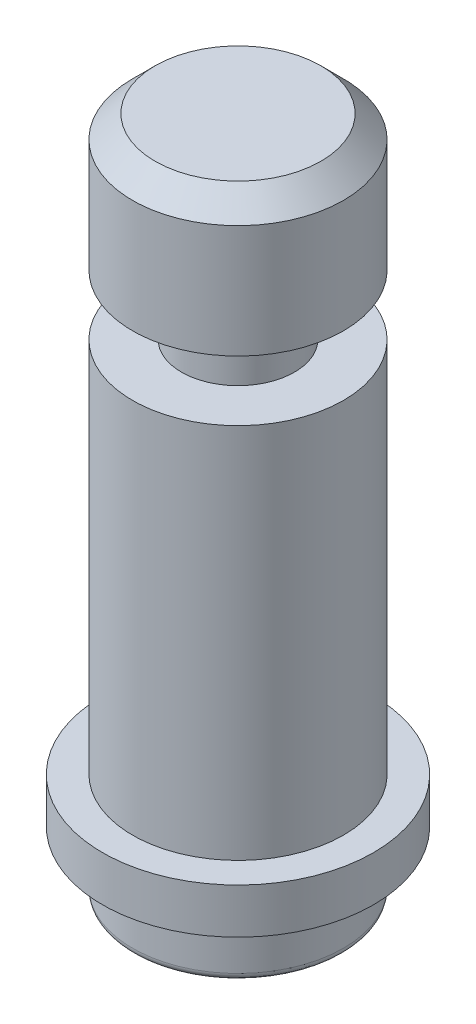
ISO-10303-21;
HEADER;
FILE_DESCRIPTION(('STEP AP214'),'2;1');
FILE_NAME('part.step','',(''),(''),'','','');
FILE_SCHEMA(('AUTOMOTIVE_DESIGN { 1 0 10303 214 1 1 1 1 }'));
ENDSEC;
DATA;
#1=APPLICATION_CONTEXT('core data for automotive mechanical design processes');
#2=APPLICATION_PROTOCOL_DEFINITION('international standard','automotive_design',2000,#1);
#3=PRODUCT_CONTEXT('',#1,'mechanical');
#4=PRODUCT('Part','Part','',(#3));
#5=PRODUCT_RELATED_PRODUCT_CATEGORY('part','',(#4));
#6=PRODUCT_DEFINITION_FORMATION('','',#4);
#7=PRODUCT_DEFINITION_CONTEXT('part definition',#1,'design');
#8=PRODUCT_DEFINITION('design','',#6,#7);
#9=PRODUCT_DEFINITION_SHAPE('','',#8);
#10=(LENGTH_UNIT() NAMED_UNIT(*) SI_UNIT(.MILLI.,.METRE.));
#11=(NAMED_UNIT(*) PLANE_ANGLE_UNIT() SI_UNIT($,.RADIAN.));
#12=(NAMED_UNIT(*) SI_UNIT($,.STERADIAN.) SOLID_ANGLE_UNIT());
#13=UNCERTAINTY_MEASURE_WITH_UNIT(LENGTH_MEASURE(1.E-05),#10,'distance_accuracy_value','');
#14=(GEOMETRIC_REPRESENTATION_CONTEXT(3) GLOBAL_UNCERTAINTY_ASSIGNED_CONTEXT((#13)) GLOBAL_UNIT_ASSIGNED_CONTEXT((#10,
#11,#12)) REPRESENTATION_CONTEXT('',''));
#15=CARTESIAN_POINT('',(0.,0.,0.));
#16=DIRECTION('',(0.,0.,1.));
#17=DIRECTION('',(1.,0.,0.));
#18=AXIS2_PLACEMENT_3D('',#15,#16,#17);
#19=CARTESIAN_POINT('',(0.,-22.5,0.));
#20=DIRECTION('',(0.,1.,0.));
#21=DIRECTION('',(-1.,0.,0.));
#22=AXIS2_PLACEMENT_3D('',#19,#20,#21);
#23=PLANE('',#22);
#24=CARTESIAN_POINT('',(0.,-22.5,0.));
#25=DIRECTION('',(0.,1.,0.));
#26=DIRECTION('',(-1.,0.,0.));
#27=AXIS2_PLACEMENT_3D('',#24,#25,#26);
#28=CIRCLE('',#27,6.50000000000001);
#29=CARTESIAN_POINT('',(-6.50000000000001,-22.5,0.));
#30=VERTEX_POINT('',#29);
#31=EDGE_CURVE('E10',#30,#30,#28,.F.);
#32=ORIENTED_EDGE('',*,*,#31,.T.);
#33=EDGE_LOOP('',(#32));
#34=FACE_BOUND('',#33,.T.);
#35=ADVANCED_FACE('F31',(#34),#23,.F.);
#36=CARTESIAN_POINT('',(0.,22.5,0.));
#37=DIRECTION('',(0.,1.,0.));
#38=DIRECTION('',(-1.,0.,0.));
#39=AXIS2_PLACEMENT_3D('',#36,#37,#38);
#40=CYLINDRICAL_SURFACE('',#39,7.00000000000001);
#41=CARTESIAN_POINT('',(0.,-22.,0.));
#42=DIRECTION('',(0.,1.,0.));
#43=DIRECTION('',(-1.,0.,0.));
#44=AXIS2_PLACEMENT_3D('',#41,#42,#43);
#45=CIRCLE('',#44,7.00000000000001);
#46=CARTESIAN_POINT('',(-7.00000000000001,-22.,0.));
#47=VERTEX_POINT('',#46);
#48=EDGE_CURVE('E38',#47,#47,#45,.T.);
#49=ORIENTED_EDGE('',*,*,#48,.T.);
#50=EDGE_LOOP('',(#49));
#51=FACE_BOUND('',#50,.T.);
#52=CARTESIAN_POINT('',(0.,-18.5,0.));
#53=DIRECTION('',(0.,1.,0.));
#54=DIRECTION('',(-1.,0.,0.));
#55=AXIS2_PLACEMENT_3D('',#52,#53,#54);
#56=CIRCLE('',#55,7.00000000000001);
#57=CARTESIAN_POINT('',(-7.00000000000001,-18.5,0.));
#58=VERTEX_POINT('',#57);
#59=EDGE_CURVE('E51',#58,#58,#56,.T.);
#60=ORIENTED_EDGE('',*,*,#59,.F.);
#61=EDGE_LOOP('',(#60));
#62=FACE_BOUND('',#61,.T.);
#63=ADVANCED_FACE('F117',(#51,#62),#40,.T.);
#64=CARTESIAN_POINT('',(7.00000000000001,-18.5,0.));
#65=DIRECTION('',(0.,1.,0.));
#66=DIRECTION('',(-1.,0.,0.));
#67=AXIS2_PLACEMENT_3D('',#64,#65,#66);
#68=PLANE('',#67);
#69=CARTESIAN_POINT('',(0.,-18.5,0.));
#70=DIRECTION('',(0.,1.,0.));
#71=DIRECTION('',(-1.,0.,0.));
#72=AXIS2_PLACEMENT_3D('',#69,#70,#71);
#73=CIRCLE('',#72,9.00000000000001);
#74=CARTESIAN_POINT('',(-9.00000000000001,-18.5,0.));
#75=VERTEX_POINT('',#74);
#76=EDGE_CURVE('E54',#75,#75,#73,.T.);
#77=ORIENTED_EDGE('',*,*,#76,.F.);
#78=EDGE_LOOP('',(#77));
#79=FACE_BOUND('',#78,.T.);
#80=ORIENTED_EDGE('',*,*,#59,.T.);
#81=EDGE_LOOP('',(#80));
#82=FACE_BOUND('',#81,.T.);
#83=ADVANCED_FACE('F111',(#79,#82),#68,.F.);
#84=CARTESIAN_POINT('',(0.,22.5,0.));
#85=DIRECTION('',(0.,1.,0.));
#86=DIRECTION('',(-1.,0.,0.));
#87=AXIS2_PLACEMENT_3D('',#84,#85,#86);
#88=CYLINDRICAL_SURFACE('',#87,9.00000000000001);
#89=CARTESIAN_POINT('',(0.,-15.5,0.));
#90=DIRECTION('',(0.,1.,0.));
#91=DIRECTION('',(-1.,0.,0.));
#92=AXIS2_PLACEMENT_3D('',#89,#90,#91);
#93=CIRCLE('',#92,9.00000000000001);
#94=CARTESIAN_POINT('',(-9.00000000000001,-15.5,0.));
#95=VERTEX_POINT('',#94);
#96=EDGE_CURVE('E57',#95,#95,#93,.T.);
#97=ORIENTED_EDGE('',*,*,#96,.F.);
#98=EDGE_LOOP('',(#97));
#99=FACE_BOUND('',#98,.T.);
#100=ORIENTED_EDGE('',*,*,#76,.T.);
#101=EDGE_LOOP('',(#100));
#102=FACE_BOUND('',#101,.T.);
#103=ADVANCED_FACE('F105',(#99,#102),#88,.T.);
#104=CARTESIAN_POINT('',(9.00000000000001,-15.5,0.));
#105=DIRECTION('',(0.,-1.,0.));
#106=DIRECTION('',(1.,0.,0.));
#107=AXIS2_PLACEMENT_3D('',#104,#105,#106);
#108=PLANE('',#107);
#109=CARTESIAN_POINT('',(0.,-15.5,0.));
#110=DIRECTION('',(0.,1.,0.));
#111=DIRECTION('',(-1.,0.,0.));
#112=AXIS2_PLACEMENT_3D('',#109,#110,#111);
#113=CIRCLE('',#112,7.00000000000001);
#114=CARTESIAN_POINT('',(-7.00000000000001,-15.5,0.));
#115=VERTEX_POINT('',#114);
#116=EDGE_CURVE('E60',#115,#115,#113,.T.);
#117=ORIENTED_EDGE('',*,*,#116,.F.);
#118=EDGE_LOOP('',(#117));
#119=FACE_BOUND('',#118,.T.);
#120=ORIENTED_EDGE('',*,*,#96,.T.);
#121=EDGE_LOOP('',(#120));
#122=FACE_BOUND('',#121,.T.);
#123=ADVANCED_FACE('F99',(#119,#122),#108,.F.);
#124=CARTESIAN_POINT('',(0.,22.5,0.));
#125=DIRECTION('',(0.,1.,0.));
#126=DIRECTION('',(-1.,0.,0.));
#127=AXIS2_PLACEMENT_3D('',#124,#125,#126);
#128=CYLINDRICAL_SURFACE('',#127,7.00000000000001);
#129=CARTESIAN_POINT('',(0.,9.5,0.));
#130=DIRECTION('',(0.,1.,0.));
#131=DIRECTION('',(-1.,0.,0.));
#132=AXIS2_PLACEMENT_3D('',#129,#130,#131);
#133=CIRCLE('',#132,7.00000000000002);
#134=CARTESIAN_POINT('',(-7.00000000000002,9.49999999999999,0.));
#135=VERTEX_POINT('',#134);
#136=EDGE_CURVE('E63',#135,#135,#133,.T.);
#137=ORIENTED_EDGE('',*,*,#136,.F.);
#138=EDGE_LOOP('',(#137));
#139=FACE_BOUND('',#138,.T.);
#140=ORIENTED_EDGE('',*,*,#116,.T.);
#141=EDGE_LOOP('',(#140));
#142=FACE_BOUND('',#141,.T.);
#143=ADVANCED_FACE('F93',(#139,#142),#128,.T.);
#144=CARTESIAN_POINT('',(7.00000000000001,9.5,0.));
#145=DIRECTION('',(0.,-1.,0.));
#146=DIRECTION('',(1.,0.,0.));
#147=AXIS2_PLACEMENT_3D('',#144,#145,#146);
#148=PLANE('',#147);
#149=CARTESIAN_POINT('',(0.,9.5,0.));
#150=DIRECTION('',(0.,1.,0.));
#151=DIRECTION('',(-1.,0.,0.));
#152=AXIS2_PLACEMENT_3D('',#149,#150,#151);
#153=CIRCLE('',#152,3.75000000000001);
#154=CARTESIAN_POINT('',(-3.75000000000002,9.5,0.));
#155=VERTEX_POINT('',#154);
#156=EDGE_CURVE('E66',#155,#155,#153,.T.);
#157=ORIENTED_EDGE('',*,*,#156,.F.);
#158=EDGE_LOOP('',(#157));
#159=FACE_BOUND('',#158,.T.);
#160=ORIENTED_EDGE('',*,*,#136,.T.);
#161=EDGE_LOOP('',(#160));
#162=FACE_BOUND('',#161,.T.);
#163=ADVANCED_FACE('F87',(#159,#162),#148,.F.);
#164=CARTESIAN_POINT('',(0.,22.5,0.));
#165=DIRECTION('',(0.,1.,0.));
#166=DIRECTION('',(-1.,0.,0.));
#167=AXIS2_PLACEMENT_3D('',#164,#165,#166);
#168=CYLINDRICAL_SURFACE('',#167,3.75000000000001);
#169=CARTESIAN_POINT('',(0.,13.5,0.));
#170=DIRECTION('',(0.,1.,0.));
#171=DIRECTION('',(-1.,0.,0.));
#172=AXIS2_PLACEMENT_3D('',#169,#170,#171);
#173=CIRCLE('',#172,3.75000000000001);
#174=CARTESIAN_POINT('',(-3.75000000000002,13.5,0.));
#175=VERTEX_POINT('',#174);
#176=EDGE_CURVE('E69',#175,#175,#173,.T.);
#177=ORIENTED_EDGE('',*,*,#176,.F.);
#178=EDGE_LOOP('',(#177));
#179=FACE_BOUND('',#178,.T.);
#180=ORIENTED_EDGE('',*,*,#156,.T.);
#181=EDGE_LOOP('',(#180));
#182=FACE_BOUND('',#181,.T.);
#183=ADVANCED_FACE('F81',(#179,#182),#168,.T.);
#184=CARTESIAN_POINT('',(3.75,13.5,0.));
#185=DIRECTION('',(0.,1.,0.));
#186=DIRECTION('',(-1.,0.,0.));
#187=AXIS2_PLACEMENT_3D('',#184,#185,#186);
#188=PLANE('',#187);
#189=CARTESIAN_POINT('',(0.,13.5,0.));
#190=DIRECTION('',(0.,1.,0.));
#191=DIRECTION('',(-1.,0.,0.));
#192=AXIS2_PLACEMENT_3D('',#189,#190,#191);
#193=CIRCLE('',#192,7.00000000000002);
#194=CARTESIAN_POINT('',(-7.00000000000003,13.5,0.));
#195=VERTEX_POINT('',#194);
#196=EDGE_CURVE('E72',#195,#195,#193,.T.);
#197=ORIENTED_EDGE('',*,*,#196,.F.);
#198=EDGE_LOOP('',(#197));
#199=FACE_BOUND('',#198,.T.);
#200=ORIENTED_EDGE('',*,*,#176,.T.);
#201=EDGE_LOOP('',(#200));
#202=FACE_BOUND('',#201,.T.);
#203=ADVANCED_FACE('F78',(#199,#202),#188,.F.);
#204=CARTESIAN_POINT('',(0.,22.5,0.));
#205=DIRECTION('',(0.,1.,0.));
#206=DIRECTION('',(-1.,0.,0.));
#207=AXIS2_PLACEMENT_3D('',#204,#205,#206);
#208=CYLINDRICAL_SURFACE('',#207,7.00000000000002);
#209=CARTESIAN_POINT('',(0.,21.,0.));
#210=DIRECTION('',(0.,-1.,0.));
#211=DIRECTION('',(1.,0.,0.));
#212=AXIS2_PLACEMENT_3D('',#209,#210,#211);
#213=CIRCLE('',#212,7.00000000000002);
#214=CARTESIAN_POINT('',(7.00000000000001,21.,0.));
#215=VERTEX_POINT('',#214);
#216=EDGE_CURVE('E42',#215,#215,#213,.T.);
#217=ORIENTED_EDGE('',*,*,#216,.T.);
#218=EDGE_LOOP('',(#217));
#219=FACE_BOUND('',#218,.T.);
#220=ORIENTED_EDGE('',*,*,#196,.T.);
#221=EDGE_LOOP('',(#220));
#222=FACE_BOUND('',#221,.T.);
#223=ADVANCED_FACE('F76',(#219,#222),#208,.T.);
#224=CARTESIAN_POINT('',(7.00000000000001,22.5,0.));
#225=DIRECTION('',(0.,-1.,0.));
#226=DIRECTION('',(1.,0.,0.));
#227=AXIS2_PLACEMENT_3D('',#224,#225,#226);
#228=PLANE('',#227);
#229=CARTESIAN_POINT('',(0.,22.5,0.));
#230=DIRECTION('',(0.,-1.,0.));
#231=DIRECTION('',(1.,0.,0.));
#232=AXIS2_PLACEMENT_3D('',#229,#230,#231);
#233=CIRCLE('',#232,5.50000000000002);
#234=CARTESIAN_POINT('',(5.5,22.5,0.));
#235=VERTEX_POINT('',#234);
#236=EDGE_CURVE('E46',#235,#235,#233,.F.);
#237=ORIENTED_EDGE('',*,*,#236,.T.);
#238=EDGE_LOOP('',(#237));
#239=FACE_BOUND('',#238,.T.);
#240=ADVANCED_FACE('F129',(#239),#228,.F.);
#241=CARTESIAN_POINT('',(0.,22.5,0.));
#242=DIRECTION('',(0.,-1.,0.));
#243=DIRECTION('',(1.,0.,0.));
#244=AXIS2_PLACEMENT_3D('',#241,#242,#243);
#245=CONICAL_SURFACE('',#244,5.50000000000002,0.785398163397447);
#246=ORIENTED_EDGE('',*,*,#216,.F.);
#247=EDGE_LOOP('',(#246));
#248=FACE_BOUND('',#247,.T.);
#249=ORIENTED_EDGE('',*,*,#236,.F.);
#250=EDGE_LOOP('',(#249));
#251=FACE_BOUND('',#250,.T.);
#252=ADVANCED_FACE('F127',(#248,#251),#245,.T.);
#253=CARTESIAN_POINT('',(0.,-22.,0.));
#254=DIRECTION('',(0.,1.,0.));
#255=DIRECTION('',(-1.,0.,0.));
#256=AXIS2_PLACEMENT_3D('',#253,#254,#255);
#257=TOROIDAL_SURFACE('',#256,6.50000000000001,0.5);
#258=ORIENTED_EDGE('',*,*,#31,.F.);
#259=EDGE_LOOP('',(#258));
#260=FACE_BOUND('',#259,.T.);
#261=ORIENTED_EDGE('',*,*,#48,.F.);
#262=EDGE_LOOP('',(#261));
#263=FACE_BOUND('',#262,.T.);
#264=ADVANCED_FACE('F33',(#260,#263),#257,.T.);
#265=CLOSED_SHELL('',(#35,#63,#83,#103,#123,#143,#163,#183,#203,#223,#240,#252,#264));
#266=MANIFOLD_SOLID_BREP('B2',#265);
#267=ADVANCED_BREP_SHAPE_REPRESENTATION('',(#18,#266),#14);
#268=SHAPE_DEFINITION_REPRESENTATION(#9,#267);
ENDSEC;
END-ISO-10303-21;
